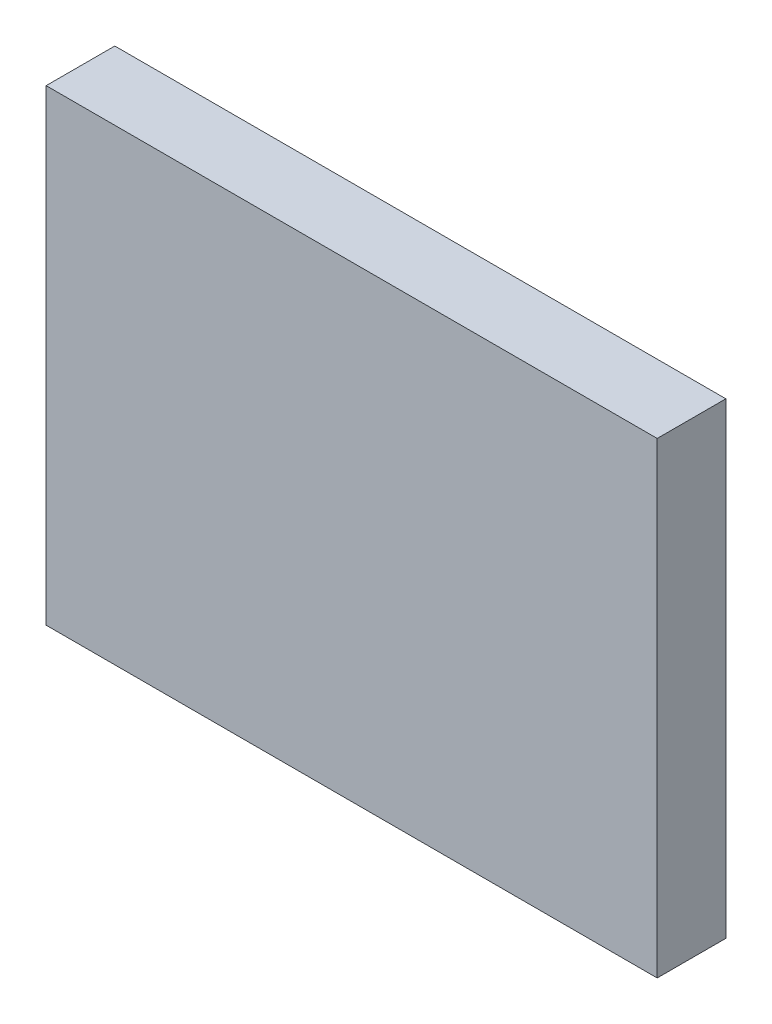
ISO-10303-21;
HEADER;
FILE_DESCRIPTION(('STEP AP214'),'2;1');
FILE_NAME('part.step','',(''),(''),'','','');
FILE_SCHEMA(('AUTOMOTIVE_DESIGN { 1 0 10303 214 1 1 1 1 }'));
ENDSEC;
DATA;
#1=APPLICATION_CONTEXT('core data for automotive mechanical design processes');
#2=APPLICATION_PROTOCOL_DEFINITION('international standard','automotive_design',2000,#1);
#3=PRODUCT_CONTEXT('',#1,'mechanical');
#4=PRODUCT('Part','Part','',(#3));
#5=PRODUCT_RELATED_PRODUCT_CATEGORY('part','',(#4));
#6=PRODUCT_DEFINITION_FORMATION('','',#4);
#7=PRODUCT_DEFINITION_CONTEXT('part definition',#1,'design');
#8=PRODUCT_DEFINITION('design','',#6,#7);
#9=PRODUCT_DEFINITION_SHAPE('','',#8);
#10=(LENGTH_UNIT() NAMED_UNIT(*) SI_UNIT(.MILLI.,.METRE.));
#11=(NAMED_UNIT(*) PLANE_ANGLE_UNIT() SI_UNIT($,.RADIAN.));
#12=(NAMED_UNIT(*) SI_UNIT($,.STERADIAN.) SOLID_ANGLE_UNIT());
#13=UNCERTAINTY_MEASURE_WITH_UNIT(LENGTH_MEASURE(1.E-05),#10,'distance_accuracy_value','');
#14=(GEOMETRIC_REPRESENTATION_CONTEXT(3) GLOBAL_UNCERTAINTY_ASSIGNED_CONTEXT((#13)) GLOBAL_UNIT_ASSIGNED_CONTEXT((#10,
#11,#12)) REPRESENTATION_CONTEXT('',''));
#15=CARTESIAN_POINT('',(0.,0.,0.));
#16=DIRECTION('',(0.,0.,1.));
#17=DIRECTION('',(1.,0.,0.));
#18=AXIS2_PLACEMENT_3D('',#15,#16,#17);
#19=CARTESIAN_POINT('',(0.49,2.54,2.16));
#20=DIRECTION('',(0.,0.,-1.));
#21=DIRECTION('',(-1.,0.,0.));
#22=AXIS2_PLACEMENT_3D('',#19,#20,#21);
#23=PLANE('',#22);
#24=DIRECTION('',(1.,0.,0.));
#25=VECTOR('',#24,1.);
#26=CARTESIAN_POINT('',(-16.51,-10.46,2.16));
#27=LINE('',#26,#25);
#28=CARTESIAN_POINT('',(-16.51,-10.46,2.16));
#29=VERTEX_POINT('',#28);
#30=CARTESIAN_POINT('',(0.49,-10.46,2.16));
#31=VERTEX_POINT('',#30);
#32=EDGE_CURVE('E68',#29,#31,#27,.T.);
#33=ORIENTED_EDGE('',*,*,#32,.T.);
#34=DIRECTION('',(0.,1.,0.));
#35=VECTOR('',#34,1.);
#36=CARTESIAN_POINT('',(0.49,-10.46,2.16));
#37=LINE('',#36,#35);
#38=CARTESIAN_POINT('',(0.49,2.54,2.16));
#39=VERTEX_POINT('',#38);
#40=EDGE_CURVE('E55',#31,#39,#37,.T.);
#41=ORIENTED_EDGE('',*,*,#40,.T.);
#42=DIRECTION('',(1.,0.,0.));
#43=VECTOR('',#42,1.);
#44=CARTESIAN_POINT('',(0.49,2.54,2.16));
#45=LINE('',#44,#43);
#46=CARTESIAN_POINT('',(-16.51,2.54,2.16));
#47=VERTEX_POINT('',#46);
#48=EDGE_CURVE('E20',#39,#47,#45,.F.);
#49=ORIENTED_EDGE('',*,*,#48,.T.);
#50=DIRECTION('',(0.,1.,0.));
#51=VECTOR('',#50,1.);
#52=CARTESIAN_POINT('',(-16.51,2.54,2.16));
#53=LINE('',#52,#51);
#54=EDGE_CURVE('E81',#47,#29,#53,.F.);
#55=ORIENTED_EDGE('',*,*,#54,.T.);
#56=EDGE_LOOP('',(#33,#41,#49,#55));
#57=FACE_BOUND('',#56,.T.);
#58=ADVANCED_FACE('F17',(#57),#23,.F.);
#59=CARTESIAN_POINT('',(0.49,2.54,0.25));
#60=DIRECTION('',(0.,-1.,0.));
#61=DIRECTION('',(0.,0.,-1.));
#62=AXIS2_PLACEMENT_3D('',#59,#60,#61);
#63=PLANE('',#62);
#64=DIRECTION('',(0.,0.,1.));
#65=VECTOR('',#64,1.);
#66=CARTESIAN_POINT('',(0.49,2.54,0.25));
#67=LINE('',#66,#65);
#68=CARTESIAN_POINT('',(0.49,2.54,0.25));
#69=VERTEX_POINT('',#68);
#70=EDGE_CURVE('E61',#39,#69,#67,.F.);
#71=ORIENTED_EDGE('',*,*,#70,.T.);
#72=DIRECTION('',(-1.,0.,0.));
#73=VECTOR('',#72,1.);
#74=CARTESIAN_POINT('',(0.49,2.54,0.25));
#75=LINE('',#74,#73);
#76=CARTESIAN_POINT('',(-16.51,2.54,0.25));
#77=VERTEX_POINT('',#76);
#78=EDGE_CURVE('E83',#77,#69,#75,.F.);
#79=ORIENTED_EDGE('',*,*,#78,.F.);
#80=DIRECTION('',(0.,0.,-1.));
#81=VECTOR('',#80,1.);
#82=CARTESIAN_POINT('',(-16.51,2.54,0.25));
#83=LINE('',#82,#81);
#84=EDGE_CURVE('E64',#77,#47,#83,.F.);
#85=ORIENTED_EDGE('',*,*,#84,.T.);
#86=ORIENTED_EDGE('',*,*,#48,.F.);
#87=EDGE_LOOP('',(#71,#79,#85,#86));
#88=FACE_BOUND('',#87,.T.);
#89=ADVANCED_FACE('F60',(#88),#63,.F.);
#90=CARTESIAN_POINT('',(0.49,-10.46,0.25));
#91=DIRECTION('',(-1.,0.,0.));
#92=DIRECTION('',(0.,0.,1.));
#93=AXIS2_PLACEMENT_3D('',#90,#91,#92);
#94=PLANE('',#93);
#95=DIRECTION('',(0.,0.,1.));
#96=VECTOR('',#95,1.);
#97=CARTESIAN_POINT('',(0.490000000000001,-10.46,0.25));
#98=LINE('',#97,#96);
#99=CARTESIAN_POINT('',(0.49,-10.46,0.25));
#100=VERTEX_POINT('',#99);
#101=EDGE_CURVE('E70',#31,#100,#98,.F.);
#102=ORIENTED_EDGE('',*,*,#101,.T.);
#103=DIRECTION('',(0.,1.,0.));
#104=VECTOR('',#103,1.);
#105=CARTESIAN_POINT('',(0.49,2.54,0.25));
#106=LINE('',#105,#104);
#107=EDGE_CURVE('E74',#69,#100,#106,.F.);
#108=ORIENTED_EDGE('',*,*,#107,.F.);
#109=ORIENTED_EDGE('',*,*,#70,.F.);
#110=ORIENTED_EDGE('',*,*,#40,.F.);
#111=EDGE_LOOP('',(#102,#108,#109,#110));
#112=FACE_BOUND('',#111,.T.);
#113=ADVANCED_FACE('F72',(#112),#94,.F.);
#114=CARTESIAN_POINT('',(-16.51,-10.46,0.25));
#115=DIRECTION('',(0.,1.,0.));
#116=DIRECTION('',(0.,0.,1.));
#117=AXIS2_PLACEMENT_3D('',#114,#115,#116);
#118=PLANE('',#117);
#119=DIRECTION('',(0.,0.,-1.));
#120=VECTOR('',#119,1.);
#121=CARTESIAN_POINT('',(-16.51,-10.46,0.25));
#122=LINE('',#121,#120);
#123=CARTESIAN_POINT('',(-16.51,-10.46,0.25));
#124=VERTEX_POINT('',#123);
#125=EDGE_CURVE('E35',#29,#124,#122,.T.);
#126=ORIENTED_EDGE('',*,*,#125,.T.);
#127=DIRECTION('',(-1.,0.,0.));
#128=VECTOR('',#127,1.);
#129=CARTESIAN_POINT('',(0.49,-10.46,0.25));
#130=LINE('',#129,#128);
#131=EDGE_CURVE('E26',#100,#124,#130,.T.);
#132=ORIENTED_EDGE('',*,*,#131,.F.);
#133=ORIENTED_EDGE('',*,*,#101,.F.);
#134=ORIENTED_EDGE('',*,*,#32,.F.);
#135=EDGE_LOOP('',(#126,#132,#133,#134));
#136=FACE_BOUND('',#135,.T.);
#137=ADVANCED_FACE('F89',(#136),#118,.F.);
#138=CARTESIAN_POINT('',(-16.51,2.54,0.25));
#139=DIRECTION('',(1.,0.,0.));
#140=DIRECTION('',(0.,0.,-1.));
#141=AXIS2_PLACEMENT_3D('',#138,#139,#140);
#142=PLANE('',#141);
#143=ORIENTED_EDGE('',*,*,#84,.F.);
#144=DIRECTION('',(0.,1.,0.));
#145=VECTOR('',#144,1.);
#146=CARTESIAN_POINT('',(-16.51,2.54,0.25));
#147=LINE('',#146,#145);
#148=EDGE_CURVE('E11',#124,#77,#147,.T.);
#149=ORIENTED_EDGE('',*,*,#148,.F.);
#150=ORIENTED_EDGE('',*,*,#125,.F.);
#151=ORIENTED_EDGE('',*,*,#54,.F.);
#152=EDGE_LOOP('',(#143,#149,#150,#151));
#153=FACE_BOUND('',#152,.T.);
#154=ADVANCED_FACE('F91',(#153),#142,.F.);
#155=CARTESIAN_POINT('',(0.49,2.54,0.25));
#156=DIRECTION('',(0.,0.,-1.));
#157=DIRECTION('',(-1.,0.,0.));
#158=AXIS2_PLACEMENT_3D('',#155,#156,#157);
#159=PLANE('',#158);
#160=ORIENTED_EDGE('',*,*,#131,.T.);
#161=ORIENTED_EDGE('',*,*,#148,.T.);
#162=ORIENTED_EDGE('',*,*,#78,.T.);
#163=ORIENTED_EDGE('',*,*,#107,.T.);
#164=EDGE_LOOP('',(#160,#161,#162,#163));
#165=FACE_BOUND('',#164,.T.);
#166=ADVANCED_FACE('F88',(#165),#159,.T.);
#167=CLOSED_SHELL('',(#58,#89,#113,#137,#154,#166));
#168=MANIFOLD_SOLID_BREP('B1',#167);
#169=ADVANCED_BREP_SHAPE_REPRESENTATION('',(#18,#168),#14);
#170=SHAPE_DEFINITION_REPRESENTATION(#9,#169);
ENDSEC;
END-ISO-10303-21;
